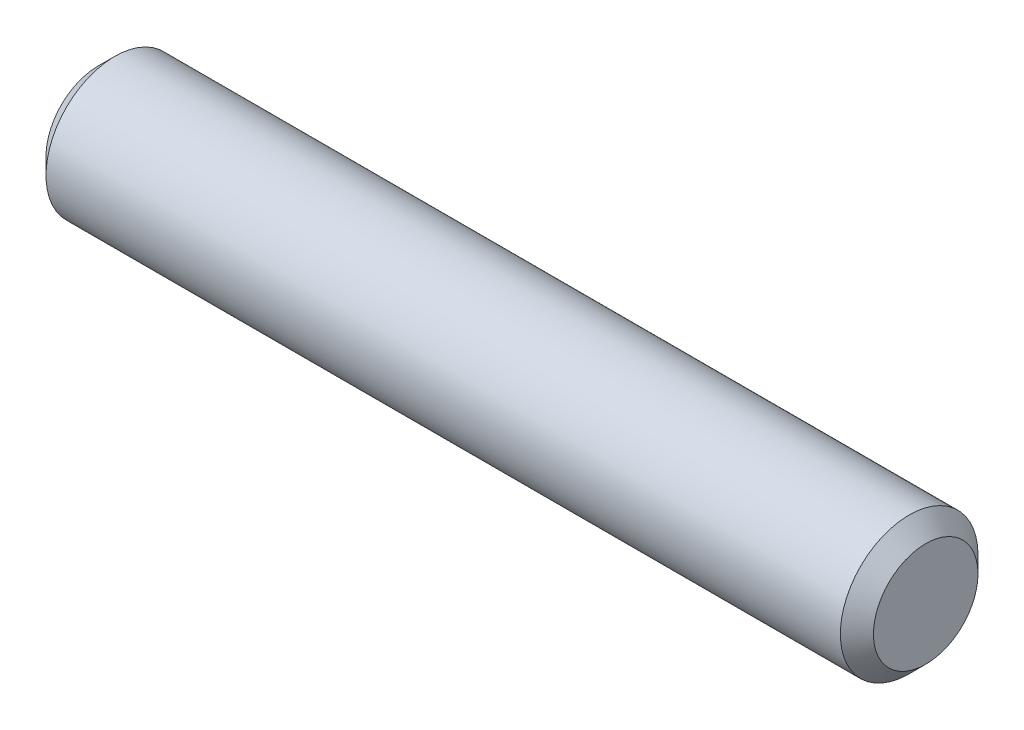
ISO-10303-21;
HEADER;
FILE_DESCRIPTION(('STEP AP214'),'2;1');
FILE_NAME('part.step','',(''),(''),'','','');
FILE_SCHEMA(('AUTOMOTIVE_DESIGN { 1 0 10303 214 1 1 1 1 }'));
ENDSEC;
DATA;
#1=APPLICATION_CONTEXT('core data for automotive mechanical design processes');
#2=APPLICATION_PROTOCOL_DEFINITION('international standard','automotive_design',2000,#1);
#3=PRODUCT_CONTEXT('',#1,'mechanical');
#4=PRODUCT('Part','Part','',(#3));
#5=PRODUCT_RELATED_PRODUCT_CATEGORY('part','',(#4));
#6=PRODUCT_DEFINITION_FORMATION('','',#4);
#7=PRODUCT_DEFINITION_CONTEXT('part definition',#1,'design');
#8=PRODUCT_DEFINITION('design','',#6,#7);
#9=PRODUCT_DEFINITION_SHAPE('','',#8);
#10=(LENGTH_UNIT() NAMED_UNIT(*) SI_UNIT(.MILLI.,.METRE.));
#11=(NAMED_UNIT(*) PLANE_ANGLE_UNIT() SI_UNIT($,.RADIAN.));
#12=(NAMED_UNIT(*) SI_UNIT($,.STERADIAN.) SOLID_ANGLE_UNIT());
#13=UNCERTAINTY_MEASURE_WITH_UNIT(LENGTH_MEASURE(1.E-05),#10,'distance_accuracy_value','');
#14=(GEOMETRIC_REPRESENTATION_CONTEXT(3) GLOBAL_UNCERTAINTY_ASSIGNED_CONTEXT((#13)) GLOBAL_UNIT_ASSIGNED_CONTEXT((#10,
#11,#12)) REPRESENTATION_CONTEXT('',''));
#15=CARTESIAN_POINT('',(0.,0.,0.));
#16=DIRECTION('',(0.,0.,1.));
#17=DIRECTION('',(1.,0.,0.));
#18=AXIS2_PLACEMENT_3D('',#15,#16,#17);
#19=CARTESIAN_POINT('',(38.1,0.,0.));
#20=DIRECTION('',(-1.,0.,0.));
#21=DIRECTION('',(0.,0.,1.));
#22=AXIS2_PLACEMENT_3D('',#19,#20,#21);
#23=CYLINDRICAL_SURFACE('',#22,6.3373);
#24=CARTESIAN_POINT('',(-36.5759999999999,0.,0.));
#25=DIRECTION('',(1.,0.,0.));
#26=DIRECTION('',(0.,0.,-1.));
#27=AXIS2_PLACEMENT_3D('',#24,#25,#26);
#28=CIRCLE('',#27,6.3373);
#29=CARTESIAN_POINT('',(-36.5759999999999,0.,-6.3373));
#30=VERTEX_POINT('',#29);
#31=EDGE_CURVE('E47',#30,#30,#28,.T.);
#32=ORIENTED_EDGE('',*,*,#31,.T.);
#33=EDGE_LOOP('',(#32));
#34=FACE_BOUND('',#33,.T.);
#35=CARTESIAN_POINT('',(36.576,0.,0.));
#36=DIRECTION('',(1.,0.,0.));
#37=DIRECTION('',(0.,0.,-1.));
#38=AXIS2_PLACEMENT_3D('',#35,#36,#37);
#39=CIRCLE('',#38,6.3373);
#40=CARTESIAN_POINT('',(36.576,0.,-6.3373));
#41=VERTEX_POINT('',#40);
#42=EDGE_CURVE('E53',#41,#41,#39,.F.);
#43=ORIENTED_EDGE('',*,*,#42,.T.);
#44=EDGE_LOOP('',(#43));
#45=FACE_BOUND('',#44,.T.);
#46=ADVANCED_FACE('F38',(#34,#45),#23,.T.);
#47=CARTESIAN_POINT('',(38.1,0.,0.));
#48=DIRECTION('',(1.,0.,0.));
#49=DIRECTION('',(0.,0.,-1.));
#50=AXIS2_PLACEMENT_3D('',#47,#48,#49);
#51=PLANE('',#50);
#52=CARTESIAN_POINT('',(38.1,0.,0.));
#53=DIRECTION('',(1.,0.,0.));
#54=DIRECTION('',(0.,0.,-1.));
#55=AXIS2_PLACEMENT_3D('',#52,#53,#54);
#56=CIRCLE('',#55,4.81330000000004);
#57=CARTESIAN_POINT('',(38.1,0.,-4.81330000000004));
#58=VERTEX_POINT('',#57);
#59=EDGE_CURVE('E59',#58,#58,#56,.T.);
#60=ORIENTED_EDGE('',*,*,#59,.T.);
#61=EDGE_LOOP('',(#60));
#62=FACE_BOUND('',#61,.T.);
#63=ADVANCED_FACE('F67',(#62),#51,.T.);
#64=CARTESIAN_POINT('',(-38.1,0.,0.));
#65=DIRECTION('',(1.,0.,0.));
#66=DIRECTION('',(0.,0.,-1.));
#67=AXIS2_PLACEMENT_3D('',#64,#65,#66);
#68=PLANE('',#67);
#69=CARTESIAN_POINT('',(-38.1,0.,0.));
#70=DIRECTION('',(1.,0.,0.));
#71=DIRECTION('',(0.,0.,-1.));
#72=AXIS2_PLACEMENT_3D('',#69,#70,#71);
#73=CIRCLE('',#72,4.81329999999993);
#74=CARTESIAN_POINT('',(-38.1,0.,-4.81329999999993));
#75=VERTEX_POINT('',#74);
#76=EDGE_CURVE('E10',#75,#75,#73,.F.);
#77=ORIENTED_EDGE('',*,*,#76,.T.);
#78=EDGE_LOOP('',(#77));
#79=FACE_BOUND('',#78,.T.);
#80=ADVANCED_FACE('F71',(#79),#68,.F.);
#81=CARTESIAN_POINT('',(38.1,0.,0.));
#82=DIRECTION('',(-1.,0.,0.));
#83=DIRECTION('',(0.,0.,1.));
#84=AXIS2_PLACEMENT_3D('',#81,#82,#83);
#85=CONICAL_SURFACE('',#84,4.81330000000004,0.785398163397447);
#86=ORIENTED_EDGE('',*,*,#42,.F.);
#87=EDGE_LOOP('',(#86));
#88=FACE_BOUND('',#87,.T.);
#89=ORIENTED_EDGE('',*,*,#59,.F.);
#90=EDGE_LOOP('',(#89));
#91=FACE_BOUND('',#90,.T.);
#92=ADVANCED_FACE('F69',(#88,#91),#85,.T.);
#93=CARTESIAN_POINT('',(-36.5759999999999,0.,0.));
#94=DIRECTION('',(1.,0.,0.));
#95=DIRECTION('',(0.,0.,-1.));
#96=AXIS2_PLACEMENT_3D('',#93,#94,#95);
#97=CONICAL_SURFACE('',#96,6.3373,0.78539816339745);
#98=ORIENTED_EDGE('',*,*,#76,.F.);
#99=EDGE_LOOP('',(#98));
#100=FACE_BOUND('',#99,.T.);
#101=ORIENTED_EDGE('',*,*,#31,.F.);
#102=EDGE_LOOP('',(#101));
#103=FACE_BOUND('',#102,.T.);
#104=ADVANCED_FACE('F41',(#100,#103),#97,.T.);
#105=CLOSED_SHELL('',(#46,#63,#80,#92,#104));
#106=MANIFOLD_SOLID_BREP('B2',#105);
#107=ADVANCED_BREP_SHAPE_REPRESENTATION('',(#18,#106),#14);
#108=SHAPE_DEFINITION_REPRESENTATION(#9,#107);
ENDSEC;
END-ISO-10303-21;
